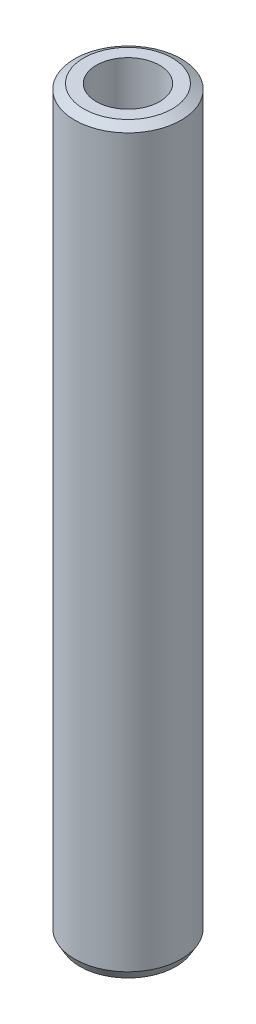
ISO-10303-21;
HEADER;
FILE_DESCRIPTION(('STEP AP214'),'2;1');
FILE_NAME('part.step','',(''),(''),'','','');
FILE_SCHEMA(('AUTOMOTIVE_DESIGN { 1 0 10303 214 1 1 1 1 }'));
ENDSEC;
DATA;
#1=APPLICATION_CONTEXT('core data for automotive mechanical design processes');
#2=APPLICATION_PROTOCOL_DEFINITION('international standard','automotive_design',2000,#1);
#3=PRODUCT_CONTEXT('',#1,'mechanical');
#4=PRODUCT('Part','Part','',(#3));
#5=PRODUCT_RELATED_PRODUCT_CATEGORY('part','',(#4));
#6=PRODUCT_DEFINITION_FORMATION('','',#4);
#7=PRODUCT_DEFINITION_CONTEXT('part definition',#1,'design');
#8=PRODUCT_DEFINITION('design','',#6,#7);
#9=PRODUCT_DEFINITION_SHAPE('','',#8);
#10=(LENGTH_UNIT() NAMED_UNIT(*) SI_UNIT(.MILLI.,.METRE.));
#11=(NAMED_UNIT(*) PLANE_ANGLE_UNIT() SI_UNIT($,.RADIAN.));
#12=(NAMED_UNIT(*) SI_UNIT($,.STERADIAN.) SOLID_ANGLE_UNIT());
#13=UNCERTAINTY_MEASURE_WITH_UNIT(LENGTH_MEASURE(1.E-05),#10,'distance_accuracy_value','');
#14=(GEOMETRIC_REPRESENTATION_CONTEXT(3) GLOBAL_UNCERTAINTY_ASSIGNED_CONTEXT((#13)) GLOBAL_UNIT_ASSIGNED_CONTEXT((#10,
#11,#12)) REPRESENTATION_CONTEXT('',''));
#15=CARTESIAN_POINT('',(0.,0.,0.));
#16=DIRECTION('',(0.,0.,1.));
#17=DIRECTION('',(1.,0.,0.));
#18=AXIS2_PLACEMENT_3D('',#15,#16,#17);
#19=CARTESIAN_POINT('',(0.,417.483825445,0.));
#20=DIRECTION('',(0.,-1.,0.));
#21=DIRECTION('',(0.,0.,-1.));
#22=AXIS2_PLACEMENT_3D('',#19,#20,#21);
#23=CYLINDRICAL_SURFACE('',#22,30.);
#24=CARTESIAN_POINT('',(0.,414.539650094658,0.));
#25=DIRECTION('',(0.,1.,0.));
#26=DIRECTION('',(0.,0.,1.));
#27=AXIS2_PLACEMENT_3D('',#24,#25,#26);
#28=CIRCLE('',#27,30.);
#29=CARTESIAN_POINT('',(0.,414.539650094658,30.));
#30=VERTEX_POINT('',#29);
#31=EDGE_CURVE('E50',#30,#30,#28,.F.);
#32=ORIENTED_EDGE('',*,*,#31,.T.);
#33=EDGE_LOOP('',(#32));
#34=FACE_BOUND('',#33,.T.);
#35=CARTESIAN_POINT('',(0.,5.09946129318567,0.));
#36=DIRECTION('',(0.,1.,0.));
#37=DIRECTION('',(0.,0.,1.));
#38=AXIS2_PLACEMENT_3D('',#35,#36,#37);
#39=CIRCLE('',#38,30.);
#40=CARTESIAN_POINT('',(0.,5.09946129318567,30.));
#41=VERTEX_POINT('',#40);
#42=EDGE_CURVE('E51',#41,#41,#39,.T.);
#43=ORIENTED_EDGE('',*,*,#42,.T.);
#44=EDGE_LOOP('',(#43));
#45=FACE_BOUND('',#44,.T.);
#46=ADVANCED_FACE('F39',(#34,#45),#23,.T.);
#47=CARTESIAN_POINT('',(0.,417.483825445,0.));
#48=DIRECTION('',(0.,1.,0.));
#49=DIRECTION('',(0.,0.,1.));
#50=AXIS2_PLACEMENT_3D('',#47,#48,#49);
#51=PLANE('',#50);
#52=CARTESIAN_POINT('',(0.,417.483825445,0.));
#53=DIRECTION('',(0.,1.,0.));
#54=DIRECTION('',(0.,0.,1.));
#55=AXIS2_PLACEMENT_3D('',#52,#53,#54);
#56=CIRCLE('',#55,24.9005387068144);
#57=CARTESIAN_POINT('',(0.,417.483825445,24.9005387068144));
#58=VERTEX_POINT('',#57);
#59=EDGE_CURVE('E54',#58,#58,#56,.T.);
#60=ORIENTED_EDGE('',*,*,#59,.T.);
#61=EDGE_LOOP('',(#60));
#62=FACE_BOUND('',#61,.T.);
#63=CARTESIAN_POINT('',(0.,417.483825445,0.));
#64=DIRECTION('',(0.,1.,0.));
#65=DIRECTION('',(0.,0.,1.));
#66=AXIS2_PLACEMENT_3D('',#63,#64,#65);
#67=CIRCLE('',#66,17.8105341977819);
#68=CARTESIAN_POINT('',(0.,417.483825445,17.8105341977819));
#69=VERTEX_POINT('',#68);
#70=EDGE_CURVE('E58',#69,#69,#67,.T.);
#71=ORIENTED_EDGE('',*,*,#70,.F.);
#72=EDGE_LOOP('',(#71));
#73=FACE_BOUND('',#72,.T.);
#74=ADVANCED_FACE('F69',(#62,#73),#51,.T.);
#75=CARTESIAN_POINT('',(0.,0.,0.));
#76=DIRECTION('',(0.,1.,0.));
#77=DIRECTION('',(0.,0.,1.));
#78=AXIS2_PLACEMENT_3D('',#75,#76,#77);
#79=PLANE('',#78);
#80=CARTESIAN_POINT('',(0.,0.,0.));
#81=DIRECTION('',(0.,1.,0.));
#82=DIRECTION('',(0.,0.,1.));
#83=AXIS2_PLACEMENT_3D('',#80,#81,#82);
#84=CIRCLE('',#83,27.0558246496572);
#85=CARTESIAN_POINT('',(0.,0.,27.0558246496572));
#86=VERTEX_POINT('',#85);
#87=EDGE_CURVE('E10',#86,#86,#84,.F.);
#88=ORIENTED_EDGE('',*,*,#87,.T.);
#89=EDGE_LOOP('',(#88));
#90=FACE_BOUND('',#89,.T.);
#91=CARTESIAN_POINT('',(0.,0.,0.));
#92=DIRECTION('',(0.,1.,0.));
#93=DIRECTION('',(0.,0.,1.));
#94=AXIS2_PLACEMENT_3D('',#91,#92,#93);
#95=CIRCLE('',#94,17.8105341977819);
#96=CARTESIAN_POINT('',(0.,0.,17.8105341977819));
#97=VERTEX_POINT('',#96);
#98=EDGE_CURVE('E63',#97,#97,#95,.T.);
#99=ORIENTED_EDGE('',*,*,#98,.T.);
#100=EDGE_LOOP('',(#99));
#101=FACE_BOUND('',#100,.T.);
#102=ADVANCED_FACE('F75',(#90,#101),#79,.F.);
#103=CARTESIAN_POINT('',(0.,417.483825445,0.));
#104=DIRECTION('',(0.,-1.,0.));
#105=DIRECTION('',(0.,0.,-1.));
#106=AXIS2_PLACEMENT_3D('',#103,#104,#105);
#107=CYLINDRICAL_SURFACE('',#106,17.8105341977819);
#108=ORIENTED_EDGE('',*,*,#70,.T.);
#109=EDGE_LOOP('',(#108));
#110=FACE_BOUND('',#109,.T.);
#111=ORIENTED_EDGE('',*,*,#98,.F.);
#112=EDGE_LOOP('',(#111));
#113=FACE_BOUND('',#112,.T.);
#114=ADVANCED_FACE('F70',(#110,#113),#107,.F.);
#115=CARTESIAN_POINT('',(0.,417.483825445,0.));
#116=DIRECTION('',(0.,-1.,0.));
#117=DIRECTION('',(0.,0.,-1.));
#118=AXIS2_PLACEMENT_3D('',#115,#116,#117);
#119=CONICAL_SURFACE('',#118,24.9005387068144,1.04719755119659);
#120=ORIENTED_EDGE('',*,*,#31,.F.);
#121=EDGE_LOOP('',(#120));
#122=FACE_BOUND('',#121,.T.);
#123=ORIENTED_EDGE('',*,*,#59,.F.);
#124=EDGE_LOOP('',(#123));
#125=FACE_BOUND('',#124,.T.);
#126=ADVANCED_FACE('F81',(#122,#125),#119,.T.);
#127=CARTESIAN_POINT('',(0.,5.09946129318567,0.));
#128=DIRECTION('',(0.,1.,0.));
#129=DIRECTION('',(0.,0.,1.));
#130=AXIS2_PLACEMENT_3D('',#127,#128,#129);
#131=CONICAL_SURFACE('',#130,30.,0.5235987755983);
#132=CARTESIAN_POINT('',(0.,0.,27.0558246496572));
#133=CARTESIAN_POINT('',(0.,0.0531193884706836,27.0864931428899));
#134=CARTESIAN_POINT('',(0.,0.106238776941368,27.1171616361226));
#135=CARTESIAN_POINT('',(0.,0.212477553882736,27.1784986225881));
#136=CARTESIAN_POINT('',(0.,0.265596942353419,27.2091671158209));
#137=CARTESIAN_POINT('',(0.,0.371835719294788,27.2705041022863));
#138=CARTESIAN_POINT('',(0.,0.424955107765472,27.3011725955191));
#139=CARTESIAN_POINT('',(0.,0.53119388470684,27.3625095819845));
#140=CARTESIAN_POINT('',(0.,0.584313273177524,27.3931780752173));
#141=CARTESIAN_POINT('',(0.,0.690552050118892,27.4545150616828));
#142=CARTESIAN_POINT('',(0.,0.743671438589576,27.4851835549155));
#143=CARTESIAN_POINT('',(0.,0.849910215530944,27.546520541381));
#144=CARTESIAN_POINT('',(0.,0.903029604001628,27.5771890346137));
#145=CARTESIAN_POINT('',(0.,1.009268380943,27.6385260210792));
#146=CARTESIAN_POINT('',(0.,1.06238776941368,27.6691945143119));
#147=CARTESIAN_POINT('',(0.,1.16862654635505,27.7305315007774));
#148=CARTESIAN_POINT('',(0.,1.22174593482573,27.7611999940101));
#149=CARTESIAN_POINT('',(0.,1.3279847117671,27.8225369804756));
#150=CARTESIAN_POINT('',(0.,1.38110410023778,27.8532054737083));
#151=CARTESIAN_POINT('',(0.,1.48734287717915,27.9145424601738));
#152=CARTESIAN_POINT('',(0.,1.54046226564984,27.9452109534066));
#153=CARTESIAN_POINT('',(0.,1.6467010425912,28.006547939872));
#154=CARTESIAN_POINT('',(0.,1.69982043106189,28.0372164331048));
#155=CARTESIAN_POINT('',(0.,1.80605920800326,28.0985534195703));
#156=CARTESIAN_POINT('',(0.,1.85917859647394,28.129221912803));
#157=CARTESIAN_POINT('',(0.,1.96541737341531,28.1905588992685));
#158=CARTESIAN_POINT('',(0.,2.01853676188599,28.2212273925012));
#159=CARTESIAN_POINT('',(0.,2.12477553882736,28.2825643789667));
#160=CARTESIAN_POINT('',(0.,2.17789492729805,28.3132328721994));
#161=CARTESIAN_POINT('',(0.,2.28413370423941,28.3745698586649));
#162=CARTESIAN_POINT('',(0.,2.3372530927101,28.4052383518976));
#163=CARTESIAN_POINT('',(0.,2.44349186965147,28.4665753383631));
#164=CARTESIAN_POINT('',(0.,2.49661125812215,28.4972438315958));
#165=CARTESIAN_POINT('',(0.,2.60285003506352,28.5585808180613));
#166=CARTESIAN_POINT('',(0.,2.6559694235342,28.5892493112941));
#167=CARTESIAN_POINT('',(0.,2.76220820047557,28.6505862977595));
#168=CARTESIAN_POINT('',(0.,2.81532758894625,28.6812547909923));
#169=CARTESIAN_POINT('',(0.,2.92156636588762,28.7425917774577));
#170=CARTESIAN_POINT('',(0.,2.97468575435831,28.7732602706905));
#171=CARTESIAN_POINT('',(0.,3.08092453129967,28.834597257156));
#172=CARTESIAN_POINT('',(0.,3.13404391977036,28.8652657503887));
#173=CARTESIAN_POINT('',(0.,3.24028269671173,28.9266027368542));
#174=CARTESIAN_POINT('',(0.,3.29340208518241,28.9572712300869));
#175=CARTESIAN_POINT('',(0.,3.39964086212378,29.0186082165524));
#176=CARTESIAN_POINT('',(0.,3.45276025059446,29.0492767097851));
#177=CARTESIAN_POINT('',(0.,3.55899902753583,29.1106136962506));
#178=CARTESIAN_POINT('',(0.,3.61211841600652,29.1412821894833));
#179=CARTESIAN_POINT('',(0.,3.71835719294788,29.2026191759488));
#180=CARTESIAN_POINT('',(0.,3.77147658141857,29.2332876691816));
#181=CARTESIAN_POINT('',(0.,3.87771535835994,29.294624655647));
#182=CARTESIAN_POINT('',(0.,3.93083474683062,29.3252931488798));
#183=CARTESIAN_POINT('',(0.,4.03707352377199,29.3866301353452));
#184=CARTESIAN_POINT('',(0.,4.09019291224267,29.417298628578));
#185=CARTESIAN_POINT('',(0.,4.19643168918404,29.4786356150435));
#186=CARTESIAN_POINT('',(0.,4.24955107765472,29.5093041082762));
#187=CARTESIAN_POINT('',(0.,4.35578985459609,29.5706410947417));
#188=CARTESIAN_POINT('',(0.,4.40890924306678,29.6013095879744));
#189=CARTESIAN_POINT('',(0.,4.51514802000814,29.6626465744399));
#190=CARTESIAN_POINT('',(0.,4.56826740847883,29.6933150676726));
#191=CARTESIAN_POINT('',(0.,4.6745061854202,29.7546520541381));
#192=CARTESIAN_POINT('',(0.,4.72762557389088,29.7853205473708));
#193=CARTESIAN_POINT('',(0.,4.83386435083225,29.8466575338363));
#194=CARTESIAN_POINT('',(0.,4.88698373930293,29.877326027069));
#195=CARTESIAN_POINT('',(0.,4.9932225162443,29.9386630135345));
#196=CARTESIAN_POINT('',(0.,5.04634190471498,29.9693315067673));
#197=CARTESIAN_POINT('',(0.,5.09946129318567,30.));
#198=B_SPLINE_CURVE_WITH_KNOTS('',3,(#132,#133,#134,#135,#136,#137,#138,#139,#140,#141,#142,
#143,#144,#145,#146,#147,#148,#149,#150,#151,#152,#153,#154,#155,#156,#157,#158,#159,#160,#161,
#162,#163,#164,#165,#166,#167,#168,#169,#170,#171,#172,#173,#174,#175,#176,#177,#178,#179,#180,
#181,#182,#183,#184,#185,#186,#187,#188,#189,#190,#191,#192,#193,#194,#195,#196,#197),
.UNSPECIFIED.,.F.,.F.,(4,2,2,2,2,2,2,2,2,2,2,2,2,2,2,2,2,2,2,2,2,2,2,2,2,2,2,2,2,2,2,2,4),(0.,
0.184010959396425,0.368021918792852,0.552032878189279,0.736043837585706,0.920054796982134,
1.10406575637856,1.28807671577499,1.47208767517141,1.65609863456784,1.84010959396426,
2.02412055336069,2.20813151275712,2.39214247215355,2.57615343154997,2.7601643909464,
2.94417535034282,3.12818630973925,3.31219726913568,3.4962082285321,3.68021918792853,
3.86423014732496,4.04824110672138,4.23225206611781,4.41626302551424,4.60027398491066,
4.78428494430709,4.96829590370352,5.15230686309994,5.33631782249637,5.5203287818928,
5.70433974128922,5.88835070068565),.UNSPECIFIED.);
#199=EDGE_CURVE('BSEAM45',#86,#41,#198,.T.);
#200=ORIENTED_EDGE('',*,*,#87,.F.);
#201=ORIENTED_EDGE('',*,*,#42,.F.);
#202=ORIENTED_EDGE('',*,*,#199,.T.);
#203=ORIENTED_EDGE('',*,*,#199,.F.);
#204=EDGE_LOOP('',(#200,#202,#201,#203));
#205=FACE_BOUND('',#204,.T.);
#206=ADVANCED_FACE('F45',(#205),#131,.T.);
#207=CLOSED_SHELL('',(#46,#74,#102,#114,#126,#206));
#208=MANIFOLD_SOLID_BREP('B2',#207);
#209=ADVANCED_BREP_SHAPE_REPRESENTATION('',(#18,#208),#14);
#210=SHAPE_DEFINITION_REPRESENTATION(#9,#209);
ENDSEC;
END-ISO-10303-21;
